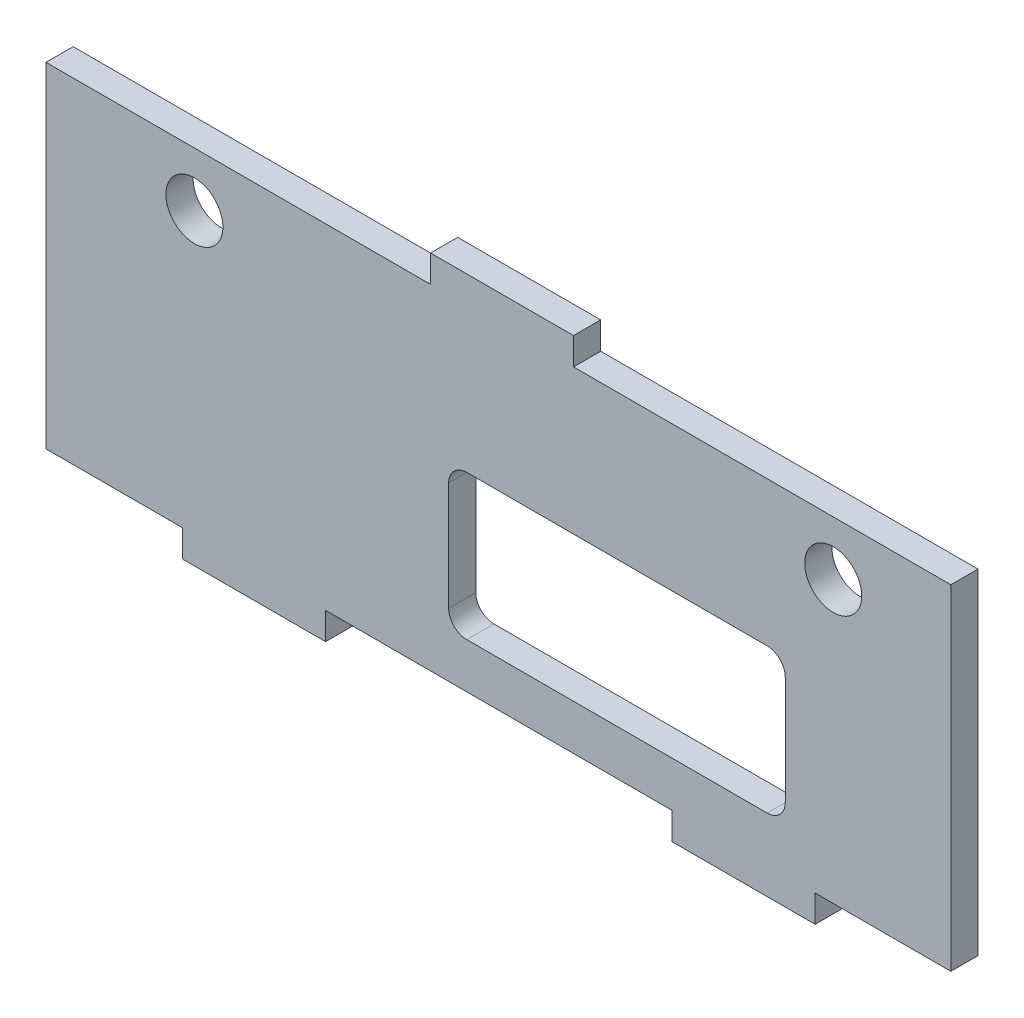
ISO-10303-21;
HEADER;
FILE_DESCRIPTION(('STEP AP214'),'2;1');
FILE_NAME('part.step','',(''),(''),'','','');
FILE_SCHEMA(('AUTOMOTIVE_DESIGN { 1 0 10303 214 1 1 1 1 }'));
ENDSEC;
DATA;
#1=APPLICATION_CONTEXT('core data for automotive mechanical design processes');
#2=APPLICATION_PROTOCOL_DEFINITION('international standard','automotive_design',2000,#1);
#3=PRODUCT_CONTEXT('',#1,'mechanical');
#4=PRODUCT('Part','Part','',(#3));
#5=PRODUCT_RELATED_PRODUCT_CATEGORY('part','',(#4));
#6=PRODUCT_DEFINITION_FORMATION('','',#4);
#7=PRODUCT_DEFINITION_CONTEXT('part definition',#1,'design');
#8=PRODUCT_DEFINITION('design','',#6,#7);
#9=PRODUCT_DEFINITION_SHAPE('','',#8);
#10=(LENGTH_UNIT() NAMED_UNIT(*) SI_UNIT(.MILLI.,.METRE.));
#11=(NAMED_UNIT(*) PLANE_ANGLE_UNIT() SI_UNIT($,.RADIAN.));
#12=(NAMED_UNIT(*) SI_UNIT($,.STERADIAN.) SOLID_ANGLE_UNIT());
#13=UNCERTAINTY_MEASURE_WITH_UNIT(LENGTH_MEASURE(1.E-05),#10,'distance_accuracy_value','');
#14=(GEOMETRIC_REPRESENTATION_CONTEXT(3) GLOBAL_UNCERTAINTY_ASSIGNED_CONTEXT((#13)) GLOBAL_UNIT_ASSIGNED_CONTEXT((#10,
#11,#12)) REPRESENTATION_CONTEXT('',''));
#15=CARTESIAN_POINT('',(0.,0.,0.));
#16=DIRECTION('',(0.,0.,1.));
#17=DIRECTION('',(1.,0.,0.));
#18=AXIS2_PLACEMENT_3D('',#15,#16,#17);
#19=CARTESIAN_POINT('',(0.,-21.5,3.));
#20=DIRECTION('',(0.,1.,0.));
#21=DIRECTION('',(-1.,0.,0.));
#22=AXIS2_PLACEMENT_3D('',#19,#20,#21);
#23=PLANE('',#22);
#24=DIRECTION('',(1.,0.,0.));
#25=VECTOR('',#24,1.);
#26=CARTESIAN_POINT('',(0.,-21.5,0.));
#27=LINE('',#26,#25);
#28=CARTESIAN_POINT('',(19.2,-21.5,0.));
#29=VERTEX_POINT('',#28);
#30=CARTESIAN_POINT('',(35.,-21.5,0.));
#31=VERTEX_POINT('',#30);
#32=EDGE_CURVE('E284',#29,#31,#27,.T.);
#33=ORIENTED_EDGE('',*,*,#32,.T.);
#34=DIRECTION('',(0.,0.,-1.));
#35=VECTOR('',#34,1.);
#36=CARTESIAN_POINT('',(35.,-21.5,3.));
#37=LINE('',#36,#35);
#38=CARTESIAN_POINT('',(35.,-21.5,3.));
#39=VERTEX_POINT('',#38);
#40=EDGE_CURVE('E11',#39,#31,#37,.T.);
#41=ORIENTED_EDGE('',*,*,#40,.F.);
#42=DIRECTION('',(1.,0.,0.));
#43=VECTOR('',#42,1.);
#44=CARTESIAN_POINT('',(0.,-21.5,3.));
#45=LINE('',#44,#43);
#46=CARTESIAN_POINT('',(19.2,-21.5,3.));
#47=VERTEX_POINT('',#46);
#48=EDGE_CURVE('E471',#47,#39,#45,.T.);
#49=ORIENTED_EDGE('',*,*,#48,.F.);
#50=DIRECTION('',(0.,0.,-1.));
#51=VECTOR('',#50,1.);
#52=CARTESIAN_POINT('',(19.2,-21.5,3.));
#53=LINE('',#52,#51);
#54=EDGE_CURVE('E61',#47,#29,#53,.T.);
#55=ORIENTED_EDGE('',*,*,#54,.T.);
#56=EDGE_LOOP('',(#33,#41,#49,#55));
#57=FACE_BOUND('',#56,.T.);
#58=ADVANCED_FACE('F41',(#57),#23,.F.);
#59=CARTESIAN_POINT('',(35.,0.,3.));
#60=DIRECTION('',(-1.,0.,0.));
#61=DIRECTION('',(0.,0.,1.));
#62=AXIS2_PLACEMENT_3D('',#59,#60,#61);
#63=PLANE('',#62);
#64=DIRECTION('',(0.,1.,0.));
#65=VECTOR('',#64,1.);
#66=CARTESIAN_POINT('',(35.,0.,0.));
#67=LINE('',#66,#65);
#68=CARTESIAN_POINT('',(35.,-18.5,0.));
#69=VERTEX_POINT('',#68);
#70=EDGE_CURVE('E287',#31,#69,#67,.T.);
#71=ORIENTED_EDGE('',*,*,#70,.T.);
#72=DIRECTION('',(0.,0.,-1.));
#73=VECTOR('',#72,1.);
#74=CARTESIAN_POINT('',(35.,-18.5,3.));
#75=LINE('',#74,#73);
#76=CARTESIAN_POINT('',(35.,-18.5,3.));
#77=VERTEX_POINT('',#76);
#78=EDGE_CURVE('E52',#77,#69,#75,.T.);
#79=ORIENTED_EDGE('',*,*,#78,.F.);
#80=DIRECTION('',(0.,1.,0.));
#81=VECTOR('',#80,1.);
#82=CARTESIAN_POINT('',(35.,0.,3.));
#83=LINE('',#82,#81);
#84=EDGE_CURVE('E474',#39,#77,#83,.T.);
#85=ORIENTED_EDGE('',*,*,#84,.F.);
#86=ORIENTED_EDGE('',*,*,#40,.T.);
#87=EDGE_LOOP('',(#71,#79,#85,#86));
#88=FACE_BOUND('',#87,.T.);
#89=ADVANCED_FACE('F539',(#88),#63,.F.);
#90=CARTESIAN_POINT('',(0.,-18.5,3.));
#91=DIRECTION('',(0.,-1.,0.));
#92=DIRECTION('',(1.,0.,0.));
#93=AXIS2_PLACEMENT_3D('',#90,#91,#92);
#94=PLANE('',#93);
#95=DIRECTION('',(-1.,0.,0.));
#96=VECTOR('',#95,1.);
#97=CARTESIAN_POINT('',(0.,-18.5,0.));
#98=LINE('',#97,#96);
#99=CARTESIAN_POINT('',(50.,-18.5,0.));
#100=VERTEX_POINT('',#99);
#101=EDGE_CURVE('E292',#100,#69,#98,.T.);
#102=ORIENTED_EDGE('',*,*,#101,.F.);
#103=DIRECTION('',(0.,0.,-1.));
#104=VECTOR('',#103,1.);
#105=CARTESIAN_POINT('',(50.,-18.5,3.));
#106=LINE('',#105,#104);
#107=CARTESIAN_POINT('',(50.,-18.5,3.));
#108=VERTEX_POINT('',#107);
#109=EDGE_CURVE('E375',#108,#100,#106,.T.);
#110=ORIENTED_EDGE('',*,*,#109,.F.);
#111=DIRECTION('',(-1.,0.,0.));
#112=VECTOR('',#111,1.);
#113=CARTESIAN_POINT('',(0.,-18.5,3.));
#114=LINE('',#113,#112);
#115=EDGE_CURVE('E477',#108,#77,#114,.T.);
#116=ORIENTED_EDGE('',*,*,#115,.T.);
#117=ORIENTED_EDGE('',*,*,#78,.T.);
#118=EDGE_LOOP('',(#102,#110,#116,#117));
#119=FACE_BOUND('',#118,.T.);
#120=ADVANCED_FACE('F543',(#119),#94,.T.);
#121=CARTESIAN_POINT('',(50.,0.,3.));
#122=DIRECTION('',(1.,0.,0.));
#123=DIRECTION('',(0.,0.,-1.));
#124=AXIS2_PLACEMENT_3D('',#121,#122,#123);
#125=PLANE('',#124);
#126=DIRECTION('',(0.,-1.,0.));
#127=VECTOR('',#126,1.);
#128=CARTESIAN_POINT('',(50.,0.,0.));
#129=LINE('',#128,#127);
#130=CARTESIAN_POINT('',(50.,18.5,0.));
#131=VERTEX_POINT('',#130);
#132=EDGE_CURVE('E296',#131,#100,#129,.T.);
#133=ORIENTED_EDGE('',*,*,#132,.F.);
#134=DIRECTION('',(0.,0.,-1.));
#135=VECTOR('',#134,1.);
#136=CARTESIAN_POINT('',(50.,18.5,3.));
#137=LINE('',#136,#135);
#138=CARTESIAN_POINT('',(50.,18.5,3.));
#139=VERTEX_POINT('',#138);
#140=EDGE_CURVE('E372',#139,#131,#137,.T.);
#141=ORIENTED_EDGE('',*,*,#140,.F.);
#142=DIRECTION('',(0.,-1.,0.));
#143=VECTOR('',#142,1.);
#144=CARTESIAN_POINT('',(50.,0.,3.));
#145=LINE('',#144,#143);
#146=EDGE_CURVE('E481',#139,#108,#145,.T.);
#147=ORIENTED_EDGE('',*,*,#146,.T.);
#148=ORIENTED_EDGE('',*,*,#109,.T.);
#149=EDGE_LOOP('',(#133,#141,#147,#148));
#150=FACE_BOUND('',#149,.T.);
#151=ADVANCED_FACE('F588',(#150),#125,.T.);
#152=CARTESIAN_POINT('',(0.,18.5,3.));
#153=DIRECTION('',(0.,-1.,0.));
#154=DIRECTION('',(1.,0.,0.));
#155=AXIS2_PLACEMENT_3D('',#152,#153,#154);
#156=PLANE('',#155);
#157=DIRECTION('',(-1.,0.,0.));
#158=VECTOR('',#157,1.);
#159=CARTESIAN_POINT('',(0.,18.5,0.));
#160=LINE('',#159,#158);
#161=CARTESIAN_POINT('',(8.30000000000001,18.5,0.));
#162=VERTEX_POINT('',#161);
#163=EDGE_CURVE('E300',#131,#162,#160,.T.);
#164=ORIENTED_EDGE('',*,*,#163,.T.);
#165=DIRECTION('',(0.,0.,-1.));
#166=VECTOR('',#165,1.);
#167=CARTESIAN_POINT('',(8.30000000000001,18.5,3.));
#168=LINE('',#167,#166);
#169=CARTESIAN_POINT('',(8.30000000000001,18.5,3.));
#170=VERTEX_POINT('',#169);
#171=EDGE_CURVE('E369',#170,#162,#168,.T.);
#172=ORIENTED_EDGE('',*,*,#171,.F.);
#173=DIRECTION('',(-1.,0.,0.));
#174=VECTOR('',#173,1.);
#175=CARTESIAN_POINT('',(0.,18.5,3.));
#176=LINE('',#175,#174);
#177=EDGE_CURVE('E485',#139,#170,#176,.T.);
#178=ORIENTED_EDGE('',*,*,#177,.F.);
#179=ORIENTED_EDGE('',*,*,#140,.T.);
#180=EDGE_LOOP('',(#164,#172,#178,#179));
#181=FACE_BOUND('',#180,.T.);
#182=ADVANCED_FACE('F592',(#181),#156,.F.);
#183=CARTESIAN_POINT('',(8.30000000000001,0.,3.));
#184=DIRECTION('',(1.,0.,0.));
#185=DIRECTION('',(0.,0.,-1.));
#186=AXIS2_PLACEMENT_3D('',#183,#184,#185);
#187=PLANE('',#186);
#188=DIRECTION('',(0.,-1.,0.));
#189=VECTOR('',#188,1.);
#190=CARTESIAN_POINT('',(8.30000000000001,0.,0.));
#191=LINE('',#190,#189);
#192=CARTESIAN_POINT('',(8.30000000000001,21.5,0.));
#193=VERTEX_POINT('',#192);
#194=EDGE_CURVE('E304',#193,#162,#191,.T.);
#195=ORIENTED_EDGE('',*,*,#194,.F.);
#196=DIRECTION('',(0.,0.,-1.));
#197=VECTOR('',#196,1.);
#198=CARTESIAN_POINT('',(8.30000000000001,21.5,3.));
#199=LINE('',#198,#197);
#200=CARTESIAN_POINT('',(8.30000000000001,21.5,3.));
#201=VERTEX_POINT('',#200);
#202=EDGE_CURVE('E366',#201,#193,#199,.T.);
#203=ORIENTED_EDGE('',*,*,#202,.F.);
#204=DIRECTION('',(0.,-1.,0.));
#205=VECTOR('',#204,1.);
#206=CARTESIAN_POINT('',(8.30000000000001,0.,3.));
#207=LINE('',#206,#205);
#208=EDGE_CURVE('E488',#201,#170,#207,.T.);
#209=ORIENTED_EDGE('',*,*,#208,.T.);
#210=ORIENTED_EDGE('',*,*,#171,.T.);
#211=EDGE_LOOP('',(#195,#203,#209,#210));
#212=FACE_BOUND('',#211,.T.);
#213=ADVANCED_FACE('F596',(#212),#187,.T.);
#214=CARTESIAN_POINT('',(0.,21.5,3.));
#215=DIRECTION('',(0.,1.,0.));
#216=DIRECTION('',(-1.,0.,0.));
#217=AXIS2_PLACEMENT_3D('',#214,#215,#216);
#218=PLANE('',#217);
#219=DIRECTION('',(1.,0.,0.));
#220=VECTOR('',#219,1.);
#221=CARTESIAN_POINT('',(0.,21.5,0.));
#222=LINE('',#221,#220);
#223=CARTESIAN_POINT('',(-7.49999999999999,21.5,0.));
#224=VERTEX_POINT('',#223);
#225=EDGE_CURVE('E308',#224,#193,#222,.T.);
#226=ORIENTED_EDGE('',*,*,#225,.F.);
#227=DIRECTION('',(0.,0.,-1.));
#228=VECTOR('',#227,1.);
#229=CARTESIAN_POINT('',(-7.49999999999999,21.5,3.));
#230=LINE('',#229,#228);
#231=CARTESIAN_POINT('',(-7.49999999999999,21.5,3.));
#232=VERTEX_POINT('',#231);
#233=EDGE_CURVE('E363',#232,#224,#230,.T.);
#234=ORIENTED_EDGE('',*,*,#233,.F.);
#235=DIRECTION('',(1.,0.,0.));
#236=VECTOR('',#235,1.);
#237=CARTESIAN_POINT('',(0.,21.5,3.));
#238=LINE('',#237,#236);
#239=EDGE_CURVE('E492',#232,#201,#238,.T.);
#240=ORIENTED_EDGE('',*,*,#239,.T.);
#241=ORIENTED_EDGE('',*,*,#202,.T.);
#242=EDGE_LOOP('',(#226,#234,#240,#241));
#243=FACE_BOUND('',#242,.T.);
#244=ADVANCED_FACE('F600',(#243),#218,.T.);
#245=CARTESIAN_POINT('',(-7.49999999999999,0.,3.));
#246=DIRECTION('',(1.,0.,0.));
#247=DIRECTION('',(0.,0.,-1.));
#248=AXIS2_PLACEMENT_3D('',#245,#246,#247);
#249=PLANE('',#248);
#250=DIRECTION('',(0.,-1.,0.));
#251=VECTOR('',#250,1.);
#252=CARTESIAN_POINT('',(-7.49999999999999,0.,0.));
#253=LINE('',#252,#251);
#254=CARTESIAN_POINT('',(-7.49999999999999,18.5,0.));
#255=VERTEX_POINT('',#254);
#256=EDGE_CURVE('E312',#224,#255,#253,.T.);
#257=ORIENTED_EDGE('',*,*,#256,.T.);
#258=DIRECTION('',(0.,0.,-1.));
#259=VECTOR('',#258,1.);
#260=CARTESIAN_POINT('',(-7.49999999999999,18.5,3.));
#261=LINE('',#260,#259);
#262=CARTESIAN_POINT('',(-7.49999999999999,18.5,3.));
#263=VERTEX_POINT('',#262);
#264=EDGE_CURVE('E360',#263,#255,#261,.T.);
#265=ORIENTED_EDGE('',*,*,#264,.F.);
#266=DIRECTION('',(0.,-1.,0.));
#267=VECTOR('',#266,1.);
#268=CARTESIAN_POINT('',(-7.49999999999999,0.,3.));
#269=LINE('',#268,#267);
#270=EDGE_CURVE('E496',#232,#263,#269,.T.);
#271=ORIENTED_EDGE('',*,*,#270,.F.);
#272=ORIENTED_EDGE('',*,*,#233,.T.);
#273=EDGE_LOOP('',(#257,#265,#271,#272));
#274=FACE_BOUND('',#273,.T.);
#275=ADVANCED_FACE('F604',(#274),#249,.F.);
#276=CARTESIAN_POINT('',(0.,18.5,3.));
#277=DIRECTION('',(0.,1.,0.));
#278=DIRECTION('',(0.,0.,1.));
#279=AXIS2_PLACEMENT_3D('',#276,#277,#278);
#280=PLANE('',#279);
#281=DIRECTION('',(1.,0.,0.));
#282=VECTOR('',#281,1.);
#283=CARTESIAN_POINT('',(0.,18.5,0.));
#284=LINE('',#283,#282);
#285=CARTESIAN_POINT('',(-50.,18.5,0.));
#286=VERTEX_POINT('',#285);
#287=EDGE_CURVE('E316',#286,#255,#284,.T.);
#288=ORIENTED_EDGE('',*,*,#287,.F.);
#289=DIRECTION('',(0.,0.,-1.));
#290=VECTOR('',#289,1.);
#291=CARTESIAN_POINT('',(-50.,18.5,3.));
#292=LINE('',#291,#290);
#293=CARTESIAN_POINT('',(-50.,18.5,3.));
#294=VERTEX_POINT('',#293);
#295=EDGE_CURVE('E357',#294,#286,#292,.T.);
#296=ORIENTED_EDGE('',*,*,#295,.F.);
#297=DIRECTION('',(1.,0.,0.));
#298=VECTOR('',#297,1.);
#299=CARTESIAN_POINT('',(0.,18.5,3.));
#300=LINE('',#299,#298);
#301=EDGE_CURVE('E499',#294,#263,#300,.T.);
#302=ORIENTED_EDGE('',*,*,#301,.T.);
#303=ORIENTED_EDGE('',*,*,#264,.T.);
#304=EDGE_LOOP('',(#288,#296,#302,#303));
#305=FACE_BOUND('',#304,.T.);
#306=ADVANCED_FACE('F608',(#305),#280,.T.);
#307=CARTESIAN_POINT('',(-50.,0.,3.));
#308=DIRECTION('',(1.,0.,0.));
#309=DIRECTION('',(0.,0.,-1.));
#310=AXIS2_PLACEMENT_3D('',#307,#308,#309);
#311=PLANE('',#310);
#312=DIRECTION('',(0.,-1.,0.));
#313=VECTOR('',#312,1.);
#314=CARTESIAN_POINT('',(-50.,0.,0.));
#315=LINE('',#314,#313);
#316=CARTESIAN_POINT('',(-50.,-18.5,0.));
#317=VERTEX_POINT('',#316);
#318=EDGE_CURVE('E320',#286,#317,#315,.T.);
#319=ORIENTED_EDGE('',*,*,#318,.T.);
#320=DIRECTION('',(0.,0.,-1.));
#321=VECTOR('',#320,1.);
#322=CARTESIAN_POINT('',(-50.,-18.5,3.));
#323=LINE('',#322,#321);
#324=CARTESIAN_POINT('',(-50.,-18.5,3.));
#325=VERTEX_POINT('',#324);
#326=EDGE_CURVE('E353',#325,#317,#323,.T.);
#327=ORIENTED_EDGE('',*,*,#326,.F.);
#328=DIRECTION('',(0.,-1.,0.));
#329=VECTOR('',#328,1.);
#330=CARTESIAN_POINT('',(-50.,0.,3.));
#331=LINE('',#330,#329);
#332=EDGE_CURVE('E503',#294,#325,#331,.T.);
#333=ORIENTED_EDGE('',*,*,#332,.F.);
#334=ORIENTED_EDGE('',*,*,#295,.T.);
#335=EDGE_LOOP('',(#319,#327,#333,#334));
#336=FACE_BOUND('',#335,.T.);
#337=ADVANCED_FACE('F612',(#336),#311,.F.);
#338=CARTESIAN_POINT('',(0.,-18.5,3.));
#339=DIRECTION('',(0.,1.,0.));
#340=DIRECTION('',(-1.,0.,0.));
#341=AXIS2_PLACEMENT_3D('',#338,#339,#340);
#342=PLANE('',#341);
#343=DIRECTION('',(1.,0.,0.));
#344=VECTOR('',#343,1.);
#345=CARTESIAN_POINT('',(0.,-18.5,0.));
#346=LINE('',#345,#344);
#347=CARTESIAN_POINT('',(-34.9,-18.5,0.));
#348=VERTEX_POINT('',#347);
#349=EDGE_CURVE('E323',#317,#348,#346,.T.);
#350=ORIENTED_EDGE('',*,*,#349,.T.);
#351=DIRECTION('',(0.,0.,-1.));
#352=VECTOR('',#351,1.);
#353=CARTESIAN_POINT('',(-34.9,-18.5,3.));
#354=LINE('',#353,#352);
#355=CARTESIAN_POINT('',(-34.9,-18.5,3.));
#356=VERTEX_POINT('',#355);
#357=EDGE_CURVE('E350',#356,#348,#354,.T.);
#358=ORIENTED_EDGE('',*,*,#357,.F.);
#359=DIRECTION('',(1.,0.,0.));
#360=VECTOR('',#359,1.);
#361=CARTESIAN_POINT('',(0.,-18.5,3.));
#362=LINE('',#361,#360);
#363=EDGE_CURVE('E506',#325,#356,#362,.T.);
#364=ORIENTED_EDGE('',*,*,#363,.F.);
#365=ORIENTED_EDGE('',*,*,#326,.T.);
#366=EDGE_LOOP('',(#350,#358,#364,#365));
#367=FACE_BOUND('',#366,.T.);
#368=ADVANCED_FACE('F521',(#367),#342,.F.);
#369=CARTESIAN_POINT('',(-34.9,0.,3.));
#370=DIRECTION('',(-1.,0.,0.));
#371=DIRECTION('',(0.,0.,1.));
#372=AXIS2_PLACEMENT_3D('',#369,#370,#371);
#373=PLANE('',#372);
#374=DIRECTION('',(0.,1.,0.));
#375=VECTOR('',#374,1.);
#376=CARTESIAN_POINT('',(-34.9,0.,0.));
#377=LINE('',#376,#375);
#378=CARTESIAN_POINT('',(-34.9,-21.5,0.));
#379=VERTEX_POINT('',#378);
#380=EDGE_CURVE('E327',#379,#348,#377,.T.);
#381=ORIENTED_EDGE('',*,*,#380,.F.);
#382=DIRECTION('',(0.,0.,-1.));
#383=VECTOR('',#382,1.);
#384=CARTESIAN_POINT('',(-34.9,-21.5,3.));
#385=LINE('',#384,#383);
#386=CARTESIAN_POINT('',(-34.9,-21.5,3.));
#387=VERTEX_POINT('',#386);
#388=EDGE_CURVE('E347',#387,#379,#385,.T.);
#389=ORIENTED_EDGE('',*,*,#388,.F.);
#390=DIRECTION('',(0.,1.,0.));
#391=VECTOR('',#390,1.);
#392=CARTESIAN_POINT('',(-34.9,0.,3.));
#393=LINE('',#392,#391);
#394=EDGE_CURVE('E508',#387,#356,#393,.T.);
#395=ORIENTED_EDGE('',*,*,#394,.T.);
#396=ORIENTED_EDGE('',*,*,#357,.T.);
#397=EDGE_LOOP('',(#381,#389,#395,#396));
#398=FACE_BOUND('',#397,.T.);
#399=ADVANCED_FACE('F514',(#398),#373,.T.);
#400=CARTESIAN_POINT('',(-19.1,-21.5,0.));
#401=VERTEX_POINT('',#400);
#402=EDGE_CURVE('E288',#379,#401,#27,.T.);
#403=ORIENTED_EDGE('',*,*,#402,.T.);
#404=DIRECTION('',(0.,0.,-1.));
#405=VECTOR('',#404,1.);
#406=CARTESIAN_POINT('',(-19.1,-21.5,3.));
#407=LINE('',#406,#405);
#408=CARTESIAN_POINT('',(-19.1,-21.5,3.));
#409=VERTEX_POINT('',#408);
#410=EDGE_CURVE('E234',#409,#401,#407,.T.);
#411=ORIENTED_EDGE('',*,*,#410,.F.);
#412=EDGE_CURVE('E220',#387,#409,#45,.T.);
#413=ORIENTED_EDGE('',*,*,#412,.F.);
#414=ORIENTED_EDGE('',*,*,#388,.T.);
#415=EDGE_LOOP('',(#403,#411,#413,#414));
#416=FACE_BOUND('',#415,.T.);
#417=ADVANCED_FACE('F529',(#416),#23,.F.);
#418=CARTESIAN_POINT('',(-19.1,0.,3.));
#419=DIRECTION('',(-1.,0.,0.));
#420=DIRECTION('',(0.,0.,1.));
#421=AXIS2_PLACEMENT_3D('',#418,#419,#420);
#422=PLANE('',#421);
#423=DIRECTION('',(0.,1.,0.));
#424=VECTOR('',#423,1.);
#425=CARTESIAN_POINT('',(-19.1,0.,0.));
#426=LINE('',#425,#424);
#427=CARTESIAN_POINT('',(-19.1,-18.5,0.));
#428=VERTEX_POINT('',#427);
#429=EDGE_CURVE('E230',#401,#428,#426,.T.);
#430=ORIENTED_EDGE('',*,*,#429,.T.);
#431=DIRECTION('',(0.,0.,-1.));
#432=VECTOR('',#431,1.);
#433=CARTESIAN_POINT('',(-19.1,-18.5,3.));
#434=LINE('',#433,#432);
#435=CARTESIAN_POINT('',(-19.1,-18.5,3.));
#436=VERTEX_POINT('',#435);
#437=EDGE_CURVE('E227',#436,#428,#434,.T.);
#438=ORIENTED_EDGE('',*,*,#437,.F.);
#439=DIRECTION('',(0.,1.,0.));
#440=VECTOR('',#439,1.);
#441=CARTESIAN_POINT('',(-19.1,0.,3.));
#442=LINE('',#441,#440);
#443=EDGE_CURVE('E211',#409,#436,#442,.T.);
#444=ORIENTED_EDGE('',*,*,#443,.F.);
#445=ORIENTED_EDGE('',*,*,#410,.T.);
#446=EDGE_LOOP('',(#430,#438,#444,#445));
#447=FACE_BOUND('',#446,.T.);
#448=ADVANCED_FACE('F228',(#447),#422,.F.);
#449=CARTESIAN_POINT('',(0.,-18.5,3.));
#450=DIRECTION('',(0.,1.,0.));
#451=DIRECTION('',(-1.,0.,0.));
#452=AXIS2_PLACEMENT_3D('',#449,#450,#451);
#453=PLANE('',#452);
#454=DIRECTION('',(1.,0.,0.));
#455=VECTOR('',#454,1.);
#456=CARTESIAN_POINT('',(0.,-18.5,0.));
#457=LINE('',#456,#455);
#458=CARTESIAN_POINT('',(19.2,-18.5,0.));
#459=VERTEX_POINT('',#458);
#460=EDGE_CURVE('E333',#428,#459,#457,.T.);
#461=ORIENTED_EDGE('',*,*,#460,.T.);
#462=DIRECTION('',(0.,0.,-1.));
#463=VECTOR('',#462,1.);
#464=CARTESIAN_POINT('',(19.2,-18.5,3.));
#465=LINE('',#464,#463);
#466=CARTESIAN_POINT('',(19.2,-18.5,3.));
#467=VERTEX_POINT('',#466);
#468=EDGE_CURVE('E136',#467,#459,#465,.T.);
#469=ORIENTED_EDGE('',*,*,#468,.F.);
#470=DIRECTION('',(1.,0.,0.));
#471=VECTOR('',#470,1.);
#472=CARTESIAN_POINT('',(0.,-18.5,3.));
#473=LINE('',#472,#471);
#474=EDGE_CURVE('E217',#436,#467,#473,.T.);
#475=ORIENTED_EDGE('',*,*,#474,.F.);
#476=ORIENTED_EDGE('',*,*,#437,.T.);
#477=EDGE_LOOP('',(#461,#469,#475,#476));
#478=FACE_BOUND('',#477,.T.);
#479=ADVANCED_FACE('F236',(#478),#453,.F.);
#480=CARTESIAN_POINT('',(-3.5,0.499999999999989,3.));
#481=DIRECTION('',(0.,0.,-1.));
#482=DIRECTION('',(-1.,0.,0.));
#483=AXIS2_PLACEMENT_3D('',#480,#481,#482);
#484=CYLINDRICAL_SURFACE('',#483,2.);
#485=CARTESIAN_POINT('',(-3.5,0.499999999999989,0.));
#486=DIRECTION('',(0.,0.,1.));
#487=DIRECTION('',(1.,0.,0.));
#488=AXIS2_PLACEMENT_3D('',#485,#486,#487);
#489=CIRCLE('',#488,2.);
#490=CARTESIAN_POINT('',(-3.5,2.49999999999999,0.));
#491=VERTEX_POINT('',#490);
#492=CARTESIAN_POINT('',(-5.5,0.499999999999989,0.));
#493=VERTEX_POINT('',#492);
#494=EDGE_CURVE('E245',#491,#493,#489,.T.);
#495=ORIENTED_EDGE('',*,*,#494,.F.);
#496=DIRECTION('',(0.,0.,-1.));
#497=VECTOR('',#496,1.);
#498=CARTESIAN_POINT('',(-3.5,2.49999999999999,3.));
#499=LINE('',#498,#497);
#500=CARTESIAN_POINT('',(-3.5,2.49999999999999,3.));
#501=VERTEX_POINT('',#500);
#502=EDGE_CURVE('E45',#501,#491,#499,.T.);
#503=ORIENTED_EDGE('',*,*,#502,.F.);
#504=CARTESIAN_POINT('',(-3.5,0.499999999999989,3.));
#505=DIRECTION('',(0.,0.,1.));
#506=DIRECTION('',(1.,0.,0.));
#507=AXIS2_PLACEMENT_3D('',#504,#505,#506);
#508=CIRCLE('',#507,2.);
#509=CARTESIAN_POINT('',(-5.5,0.499999999999989,3.));
#510=VERTEX_POINT('',#509);
#511=EDGE_CURVE('E340',#501,#510,#508,.T.);
#512=ORIENTED_EDGE('',*,*,#511,.T.);
#513=DIRECTION('',(0.,0.,-1.));
#514=VECTOR('',#513,1.);
#515=CARTESIAN_POINT('',(-5.5,0.499999999999989,3.));
#516=LINE('',#515,#514);
#517=EDGE_CURVE('E241',#510,#493,#516,.T.);
#518=ORIENTED_EDGE('',*,*,#517,.T.);
#519=EDGE_LOOP('',(#495,#503,#512,#518));
#520=FACE_BOUND('',#519,.T.);
#521=ADVANCED_FACE('F43',(#520),#484,.F.);
#522=CARTESIAN_POINT('',(0.,2.49999999999999,3.));
#523=DIRECTION('',(0.,1.,0.));
#524=DIRECTION('',(0.,0.,1.));
#525=AXIS2_PLACEMENT_3D('',#522,#523,#524);
#526=PLANE('',#525);
#527=DIRECTION('',(1.,0.,0.));
#528=VECTOR('',#527,1.);
#529=CARTESIAN_POINT('',(0.,2.49999999999999,0.));
#530=LINE('',#529,#528);
#531=CARTESIAN_POINT('',(29.7,2.49999999999999,0.));
#532=VERTEX_POINT('',#531);
#533=EDGE_CURVE('E249',#491,#532,#530,.T.);
#534=ORIENTED_EDGE('',*,*,#533,.T.);
#535=DIRECTION('',(0.,0.,-1.));
#536=VECTOR('',#535,1.);
#537=CARTESIAN_POINT('',(29.7,2.49999999999999,3.));
#538=LINE('',#537,#536);
#539=CARTESIAN_POINT('',(29.7,2.49999999999999,3.));
#540=VERTEX_POINT('',#539);
#541=EDGE_CURVE('E397',#540,#532,#538,.T.);
#542=ORIENTED_EDGE('',*,*,#541,.F.);
#543=DIRECTION('',(1.,0.,0.));
#544=VECTOR('',#543,1.);
#545=CARTESIAN_POINT('',(0.,2.49999999999999,3.));
#546=LINE('',#545,#544);
#547=EDGE_CURVE('E407',#501,#540,#546,.T.);
#548=ORIENTED_EDGE('',*,*,#547,.F.);
#549=ORIENTED_EDGE('',*,*,#502,.T.);
#550=EDGE_LOOP('',(#534,#542,#548,#549));
#551=FACE_BOUND('',#550,.T.);
#552=ADVANCED_FACE('F406',(#551),#526,.F.);
#553=CARTESIAN_POINT('',(29.7,0.499999999999989,3.));
#554=DIRECTION('',(0.,0.,-1.));
#555=DIRECTION('',(-1.,0.,0.));
#556=AXIS2_PLACEMENT_3D('',#553,#554,#555);
#557=CYLINDRICAL_SURFACE('',#556,2.);
#558=CARTESIAN_POINT('',(29.7,0.499999999999989,0.));
#559=DIRECTION('',(0.,0.,1.));
#560=DIRECTION('',(1.,0.,0.));
#561=AXIS2_PLACEMENT_3D('',#558,#559,#560);
#562=CIRCLE('',#561,2.);
#563=CARTESIAN_POINT('',(31.7,0.499999999999989,0.));
#564=VERTEX_POINT('',#563);
#565=EDGE_CURVE('E253',#564,#532,#562,.T.);
#566=ORIENTED_EDGE('',*,*,#565,.F.);
#567=DIRECTION('',(0.,0.,-1.));
#568=VECTOR('',#567,1.);
#569=CARTESIAN_POINT('',(31.7,0.499999999999989,3.));
#570=LINE('',#569,#568);
#571=CARTESIAN_POINT('',(31.7,0.499999999999989,3.));
#572=VERTEX_POINT('',#571);
#573=EDGE_CURVE('E395',#572,#564,#570,.T.);
#574=ORIENTED_EDGE('',*,*,#573,.F.);
#575=CARTESIAN_POINT('',(29.7,0.499999999999989,3.));
#576=DIRECTION('',(0.,0.,1.));
#577=DIRECTION('',(1.,0.,0.));
#578=AXIS2_PLACEMENT_3D('',#575,#576,#577);
#579=CIRCLE('',#578,2.);
#580=EDGE_CURVE('E441',#572,#540,#579,.T.);
#581=ORIENTED_EDGE('',*,*,#580,.T.);
#582=ORIENTED_EDGE('',*,*,#541,.T.);
#583=EDGE_LOOP('',(#566,#574,#581,#582));
#584=FACE_BOUND('',#583,.T.);
#585=ADVANCED_FACE('F438',(#584),#557,.F.);
#586=CARTESIAN_POINT('',(31.7,0.,3.));
#587=DIRECTION('',(1.,0.,0.));
#588=DIRECTION('',(0.,0.,-1.));
#589=AXIS2_PLACEMENT_3D('',#586,#587,#588);
#590=PLANE('',#589);
#591=DIRECTION('',(0.,-1.,0.));
#592=VECTOR('',#591,1.);
#593=CARTESIAN_POINT('',(31.7,0.,0.));
#594=LINE('',#593,#592);
#595=CARTESIAN_POINT('',(31.7,-11.5,0.));
#596=VERTEX_POINT('',#595);
#597=EDGE_CURVE('E257',#564,#596,#594,.T.);
#598=ORIENTED_EDGE('',*,*,#597,.T.);
#599=DIRECTION('',(0.,0.,-1.));
#600=VECTOR('',#599,1.);
#601=CARTESIAN_POINT('',(31.7,-11.5,3.));
#602=LINE('',#601,#600);
#603=CARTESIAN_POINT('',(31.7,-11.5,3.));
#604=VERTEX_POINT('',#603);
#605=EDGE_CURVE('E391',#604,#596,#602,.T.);
#606=ORIENTED_EDGE('',*,*,#605,.F.);
#607=DIRECTION('',(0.,-1.,0.));
#608=VECTOR('',#607,1.);
#609=CARTESIAN_POINT('',(31.7,0.,3.));
#610=LINE('',#609,#608);
#611=EDGE_CURVE('E442',#572,#604,#610,.T.);
#612=ORIENTED_EDGE('',*,*,#611,.F.);
#613=ORIENTED_EDGE('',*,*,#573,.T.);
#614=EDGE_LOOP('',(#598,#606,#612,#613));
#615=FACE_BOUND('',#614,.T.);
#616=ADVANCED_FACE('F443',(#615),#590,.F.);
#617=CARTESIAN_POINT('',(29.7,-11.5,3.));
#618=DIRECTION('',(0.,0.,-1.));
#619=DIRECTION('',(-1.,0.,0.));
#620=AXIS2_PLACEMENT_3D('',#617,#618,#619);
#621=CYLINDRICAL_SURFACE('',#620,2.);
#622=CARTESIAN_POINT('',(29.7,-11.5,0.));
#623=DIRECTION('',(0.,0.,1.));
#624=DIRECTION('',(1.,0.,0.));
#625=AXIS2_PLACEMENT_3D('',#622,#623,#624);
#626=CIRCLE('',#625,2.);
#627=CARTESIAN_POINT('',(29.7,-13.5,0.));
#628=VERTEX_POINT('',#627);
#629=EDGE_CURVE('E260',#596,#628,#626,.F.);
#630=ORIENTED_EDGE('',*,*,#629,.T.);
#631=DIRECTION('',(0.,0.,-1.));
#632=VECTOR('',#631,1.);
#633=CARTESIAN_POINT('',(29.7,-13.5,3.));
#634=LINE('',#633,#632);
#635=CARTESIAN_POINT('',(29.7,-13.5,3.));
#636=VERTEX_POINT('',#635);
#637=EDGE_CURVE('E388',#636,#628,#634,.T.);
#638=ORIENTED_EDGE('',*,*,#637,.F.);
#639=CARTESIAN_POINT('',(29.7,-11.5,3.));
#640=DIRECTION('',(0.,0.,1.));
#641=DIRECTION('',(1.,0.,0.));
#642=AXIS2_PLACEMENT_3D('',#639,#640,#641);
#643=CIRCLE('',#642,2.);
#644=EDGE_CURVE('E446',#604,#636,#643,.F.);
#645=ORIENTED_EDGE('',*,*,#644,.F.);
#646=ORIENTED_EDGE('',*,*,#605,.T.);
#647=EDGE_LOOP('',(#630,#638,#645,#646));
#648=FACE_BOUND('',#647,.T.);
#649=ADVANCED_FACE('F435',(#648),#621,.F.);
#650=CARTESIAN_POINT('',(0.,-13.5,3.));
#651=DIRECTION('',(0.,1.,0.));
#652=DIRECTION('',(0.,0.,1.));
#653=AXIS2_PLACEMENT_3D('',#650,#651,#652);
#654=PLANE('',#653);
#655=DIRECTION('',(1.,0.,0.));
#656=VECTOR('',#655,1.);
#657=CARTESIAN_POINT('',(0.,-13.5,0.));
#658=LINE('',#657,#656);
#659=CARTESIAN_POINT('',(-3.5,-13.5,0.));
#660=VERTEX_POINT('',#659);
#661=EDGE_CURVE('E264',#660,#628,#658,.T.);
#662=ORIENTED_EDGE('',*,*,#661,.F.);
#663=DIRECTION('',(0.,0.,-1.));
#664=VECTOR('',#663,1.);
#665=CARTESIAN_POINT('',(-3.5,-13.5,3.));
#666=LINE('',#665,#664);
#667=CARTESIAN_POINT('',(-3.5,-13.5,3.));
#668=VERTEX_POINT('',#667);
#669=EDGE_CURVE('E385',#668,#660,#666,.T.);
#670=ORIENTED_EDGE('',*,*,#669,.F.);
#671=DIRECTION('',(1.,0.,0.));
#672=VECTOR('',#671,1.);
#673=CARTESIAN_POINT('',(0.,-13.5,3.));
#674=LINE('',#673,#672);
#675=EDGE_CURVE('E432',#668,#636,#674,.T.);
#676=ORIENTED_EDGE('',*,*,#675,.T.);
#677=ORIENTED_EDGE('',*,*,#637,.T.);
#678=EDGE_LOOP('',(#662,#670,#676,#677));
#679=FACE_BOUND('',#678,.T.);
#680=ADVANCED_FACE('F430',(#679),#654,.T.);
#681=CARTESIAN_POINT('',(-3.5,-11.5,3.));
#682=DIRECTION('',(0.,0.,-1.));
#683=DIRECTION('',(-1.,0.,0.));
#684=AXIS2_PLACEMENT_3D('',#681,#682,#683);
#685=CYLINDRICAL_SURFACE('',#684,2.);
#686=CARTESIAN_POINT('',(-3.5,-11.5,0.));
#687=DIRECTION('',(0.,0.,1.));
#688=DIRECTION('',(1.,0.,0.));
#689=AXIS2_PLACEMENT_3D('',#686,#687,#688);
#690=CIRCLE('',#689,2.);
#691=CARTESIAN_POINT('',(-5.5,-11.5,0.));
#692=VERTEX_POINT('',#691);
#693=EDGE_CURVE('E268',#692,#660,#690,.T.);
#694=ORIENTED_EDGE('',*,*,#693,.F.);
#695=DIRECTION('',(0.,0.,-1.));
#696=VECTOR('',#695,1.);
#697=CARTESIAN_POINT('',(-5.5,-11.5,3.));
#698=LINE('',#697,#696);
#699=CARTESIAN_POINT('',(-5.5,-11.5,3.));
#700=VERTEX_POINT('',#699);
#701=EDGE_CURVE('E382',#700,#692,#698,.T.);
#702=ORIENTED_EDGE('',*,*,#701,.F.);
#703=CARTESIAN_POINT('',(-3.5,-11.5,3.));
#704=DIRECTION('',(0.,0.,1.));
#705=DIRECTION('',(1.,0.,0.));
#706=AXIS2_PLACEMENT_3D('',#703,#704,#705);
#707=CIRCLE('',#706,2.);
#708=EDGE_CURVE('E426',#700,#668,#707,.T.);
#709=ORIENTED_EDGE('',*,*,#708,.T.);
#710=ORIENTED_EDGE('',*,*,#669,.T.);
#711=EDGE_LOOP('',(#694,#702,#709,#710));
#712=FACE_BOUND('',#711,.T.);
#713=ADVANCED_FACE('F423',(#712),#685,.F.);
#714=CARTESIAN_POINT('',(37.,12.5,3.));
#715=DIRECTION('',(0.,0.,-1.));
#716=DIRECTION('',(-1.,0.,0.));
#717=AXIS2_PLACEMENT_3D('',#714,#715,#716);
#718=CYLINDRICAL_SURFACE('',#717,3.15);
#719=CARTESIAN_POINT('',(37.,12.5,3.));
#720=DIRECTION('',(0.,0.,1.));
#721=DIRECTION('',(1.,0.,0.));
#722=AXIS2_PLACEMENT_3D('',#719,#720,#721);
#723=CIRCLE('',#722,3.15);
#724=CARTESIAN_POINT('',(40.15,12.5,3.));
#725=VERTEX_POINT('',#724);
#726=EDGE_CURVE('E467',#725,#725,#723,.T.);
#727=ORIENTED_EDGE('',*,*,#726,.T.);
#728=EDGE_LOOP('',(#727));
#729=FACE_BOUND('',#728,.T.);
#730=CARTESIAN_POINT('',(37.,12.5,0.));
#731=DIRECTION('',(0.,0.,1.));
#732=DIRECTION('',(1.,0.,0.));
#733=AXIS2_PLACEMENT_3D('',#730,#731,#732);
#734=CIRCLE('',#733,3.15);
#735=CARTESIAN_POINT('',(40.15,12.5,0.));
#736=VERTEX_POINT('',#735);
#737=EDGE_CURVE('E280',#736,#736,#734,.T.);
#738=ORIENTED_EDGE('',*,*,#737,.F.);
#739=EDGE_LOOP('',(#738));
#740=FACE_BOUND('',#739,.T.);
#741=ADVANCED_FACE('F578',(#729,#740),#718,.F.);
#742=CARTESIAN_POINT('',(-33.6,12.4999999999995,3.));
#743=DIRECTION('',(0.,0.,-1.));
#744=DIRECTION('',(-1.,0.,0.));
#745=AXIS2_PLACEMENT_3D('',#742,#743,#744);
#746=CYLINDRICAL_SURFACE('',#745,3.15);
#747=CARTESIAN_POINT('',(-33.6,12.4999999999995,3.));
#748=DIRECTION('',(0.,0.,1.));
#749=DIRECTION('',(1.,0.,0.));
#750=AXIS2_PLACEMENT_3D('',#747,#748,#749);
#751=CIRCLE('',#750,3.15);
#752=CARTESIAN_POINT('',(-30.45,12.4999999999995,3.));
#753=VERTEX_POINT('',#752);
#754=EDGE_CURVE('E463',#753,#753,#751,.T.);
#755=ORIENTED_EDGE('',*,*,#754,.T.);
#756=EDGE_LOOP('',(#755));
#757=FACE_BOUND('',#756,.T.);
#758=CARTESIAN_POINT('',(-33.6,12.4999999999995,0.));
#759=DIRECTION('',(0.,0.,1.));
#760=DIRECTION('',(1.,0.,0.));
#761=AXIS2_PLACEMENT_3D('',#758,#759,#760);
#762=CIRCLE('',#761,3.15);
#763=CARTESIAN_POINT('',(-30.45,12.4999999999995,0.));
#764=VERTEX_POINT('',#763);
#765=EDGE_CURVE('E276',#764,#764,#762,.T.);
#766=ORIENTED_EDGE('',*,*,#765,.F.);
#767=EDGE_LOOP('',(#766));
#768=FACE_BOUND('',#767,.T.);
#769=ADVANCED_FACE('F555',(#757,#768),#746,.F.);
#770=CARTESIAN_POINT('',(-5.5,0.,3.));
#771=DIRECTION('',(1.,0.,0.));
#772=DIRECTION('',(0.,1.,0.));
#773=AXIS2_PLACEMENT_3D('',#770,#771,#772);
#774=PLANE('',#773);
#775=DIRECTION('',(0.,-1.,0.));
#776=VECTOR('',#775,1.);
#777=CARTESIAN_POINT('',(-5.5,0.,0.));
#778=LINE('',#777,#776);
#779=EDGE_CURVE('E272',#493,#692,#778,.T.);
#780=ORIENTED_EDGE('',*,*,#779,.F.);
#781=ORIENTED_EDGE('',*,*,#517,.F.);
#782=DIRECTION('',(0.,-1.,0.));
#783=VECTOR('',#782,1.);
#784=CARTESIAN_POINT('',(-5.5,0.,3.));
#785=LINE('',#784,#783);
#786=EDGE_CURVE('E418',#510,#700,#785,.T.);
#787=ORIENTED_EDGE('',*,*,#786,.T.);
#788=ORIENTED_EDGE('',*,*,#701,.T.);
#789=EDGE_LOOP('',(#780,#781,#787,#788));
#790=FACE_BOUND('',#789,.T.);
#791=ADVANCED_FACE('F417',(#790),#774,.T.);
#792=CARTESIAN_POINT('',(19.2,0.,3.));
#793=DIRECTION('',(-1.,0.,0.));
#794=DIRECTION('',(0.,0.,1.));
#795=AXIS2_PLACEMENT_3D('',#792,#793,#794);
#796=PLANE('',#795);
#797=DIRECTION('',(0.,1.,0.));
#798=VECTOR('',#797,1.);
#799=CARTESIAN_POINT('',(19.2,0.,0.));
#800=LINE('',#799,#798);
#801=EDGE_CURVE('E336',#29,#459,#800,.T.);
#802=ORIENTED_EDGE('',*,*,#801,.F.);
#803=ORIENTED_EDGE('',*,*,#54,.F.);
#804=DIRECTION('',(0.,1.,0.));
#805=VECTOR('',#804,1.);
#806=CARTESIAN_POINT('',(19.2,0.,3.));
#807=LINE('',#806,#805);
#808=EDGE_CURVE('E238',#47,#467,#807,.T.);
#809=ORIENTED_EDGE('',*,*,#808,.T.);
#810=ORIENTED_EDGE('',*,*,#468,.T.);
#811=EDGE_LOOP('',(#802,#803,#809,#810));
#812=FACE_BOUND('',#811,.T.);
#813=ADVANCED_FACE('F547',(#812),#796,.T.);
#814=CARTESIAN_POINT('',(0.,0.,3.));
#815=DIRECTION('',(0.,0.,1.));
#816=DIRECTION('',(1.,0.,0.));
#817=AXIS2_PLACEMENT_3D('',#814,#815,#816);
#818=PLANE('',#817);
#819=ORIENTED_EDGE('',*,*,#511,.F.);
#820=ORIENTED_EDGE('',*,*,#547,.T.);
#821=ORIENTED_EDGE('',*,*,#580,.F.);
#822=ORIENTED_EDGE('',*,*,#611,.T.);
#823=ORIENTED_EDGE('',*,*,#644,.T.);
#824=ORIENTED_EDGE('',*,*,#675,.F.);
#825=ORIENTED_EDGE('',*,*,#708,.F.);
#826=ORIENTED_EDGE('',*,*,#786,.F.);
#827=EDGE_LOOP('',(#819,#820,#821,#822,#823,#824,#825,#826));
#828=FACE_BOUND('',#827,.T.);
#829=ORIENTED_EDGE('',*,*,#754,.F.);
#830=EDGE_LOOP('',(#829));
#831=FACE_BOUND('',#830,.T.);
#832=ORIENTED_EDGE('',*,*,#726,.F.);
#833=EDGE_LOOP('',(#832));
#834=FACE_BOUND('',#833,.T.);
#835=ORIENTED_EDGE('',*,*,#48,.T.);
#836=ORIENTED_EDGE('',*,*,#84,.T.);
#837=ORIENTED_EDGE('',*,*,#115,.F.);
#838=ORIENTED_EDGE('',*,*,#146,.F.);
#839=ORIENTED_EDGE('',*,*,#177,.T.);
#840=ORIENTED_EDGE('',*,*,#208,.F.);
#841=ORIENTED_EDGE('',*,*,#239,.F.);
#842=ORIENTED_EDGE('',*,*,#270,.T.);
#843=ORIENTED_EDGE('',*,*,#301,.F.);
#844=ORIENTED_EDGE('',*,*,#332,.T.);
#845=ORIENTED_EDGE('',*,*,#363,.T.);
#846=ORIENTED_EDGE('',*,*,#394,.F.);
#847=ORIENTED_EDGE('',*,*,#412,.T.);
#848=ORIENTED_EDGE('',*,*,#443,.T.);
#849=ORIENTED_EDGE('',*,*,#474,.T.);
#850=ORIENTED_EDGE('',*,*,#808,.F.);
#851=EDGE_LOOP('',(#835,#836,#837,#838,#839,#840,#841,#842,#843,#844,#845,#846,#847,#848,#849,#850));
#852=FACE_BOUND('',#851,.T.);
#853=ADVANCED_FACE('F214',(#828,#831,#834,#852),#818,.T.);
#854=CARTESIAN_POINT('',(0.,0.,0.));
#855=DIRECTION('',(0.,0.,1.));
#856=DIRECTION('',(1.,0.,0.));
#857=AXIS2_PLACEMENT_3D('',#854,#855,#856);
#858=PLANE('',#857);
#859=ORIENTED_EDGE('',*,*,#494,.T.);
#860=ORIENTED_EDGE('',*,*,#779,.T.);
#861=ORIENTED_EDGE('',*,*,#693,.T.);
#862=ORIENTED_EDGE('',*,*,#661,.T.);
#863=ORIENTED_EDGE('',*,*,#629,.F.);
#864=ORIENTED_EDGE('',*,*,#597,.F.);
#865=ORIENTED_EDGE('',*,*,#565,.T.);
#866=ORIENTED_EDGE('',*,*,#533,.F.);
#867=EDGE_LOOP('',(#859,#860,#861,#862,#863,#864,#865,#866));
#868=FACE_BOUND('',#867,.T.);
#869=ORIENTED_EDGE('',*,*,#765,.T.);
#870=EDGE_LOOP('',(#869));
#871=FACE_BOUND('',#870,.T.);
#872=ORIENTED_EDGE('',*,*,#737,.T.);
#873=EDGE_LOOP('',(#872));
#874=FACE_BOUND('',#873,.T.);
#875=ORIENTED_EDGE('',*,*,#32,.F.);
#876=ORIENTED_EDGE('',*,*,#801,.T.);
#877=ORIENTED_EDGE('',*,*,#460,.F.);
#878=ORIENTED_EDGE('',*,*,#429,.F.);
#879=ORIENTED_EDGE('',*,*,#402,.F.);
#880=ORIENTED_EDGE('',*,*,#380,.T.);
#881=ORIENTED_EDGE('',*,*,#349,.F.);
#882=ORIENTED_EDGE('',*,*,#318,.F.);
#883=ORIENTED_EDGE('',*,*,#287,.T.);
#884=ORIENTED_EDGE('',*,*,#256,.F.);
#885=ORIENTED_EDGE('',*,*,#225,.T.);
#886=ORIENTED_EDGE('',*,*,#194,.T.);
#887=ORIENTED_EDGE('',*,*,#163,.F.);
#888=ORIENTED_EDGE('',*,*,#132,.T.);
#889=ORIENTED_EDGE('',*,*,#101,.T.);
#890=ORIENTED_EDGE('',*,*,#70,.F.);
#891=EDGE_LOOP('',(#875,#876,#877,#878,#879,#880,#881,#882,#883,#884,#885,#886,#887,#888,#889,#890));
#892=FACE_BOUND('',#891,.T.);
#893=ADVANCED_FACE('F410',(#868,#871,#874,#892),#858,.F.);
#894=CLOSED_SHELL('',(#58,#89,#120,#151,#182,#213,#244,#275,#306,#337,#368,#399,#417,#448,#479,
#521,#552,#585,#616,#649,#680,#713,#741,#769,#791,#813,#853,#893));
#895=MANIFOLD_SOLID_BREP('B2',#894);
#896=ADVANCED_BREP_SHAPE_REPRESENTATION('',(#18,#895),#14);
#897=SHAPE_DEFINITION_REPRESENTATION(#9,#896);
ENDSEC;
END-ISO-10303-21;
